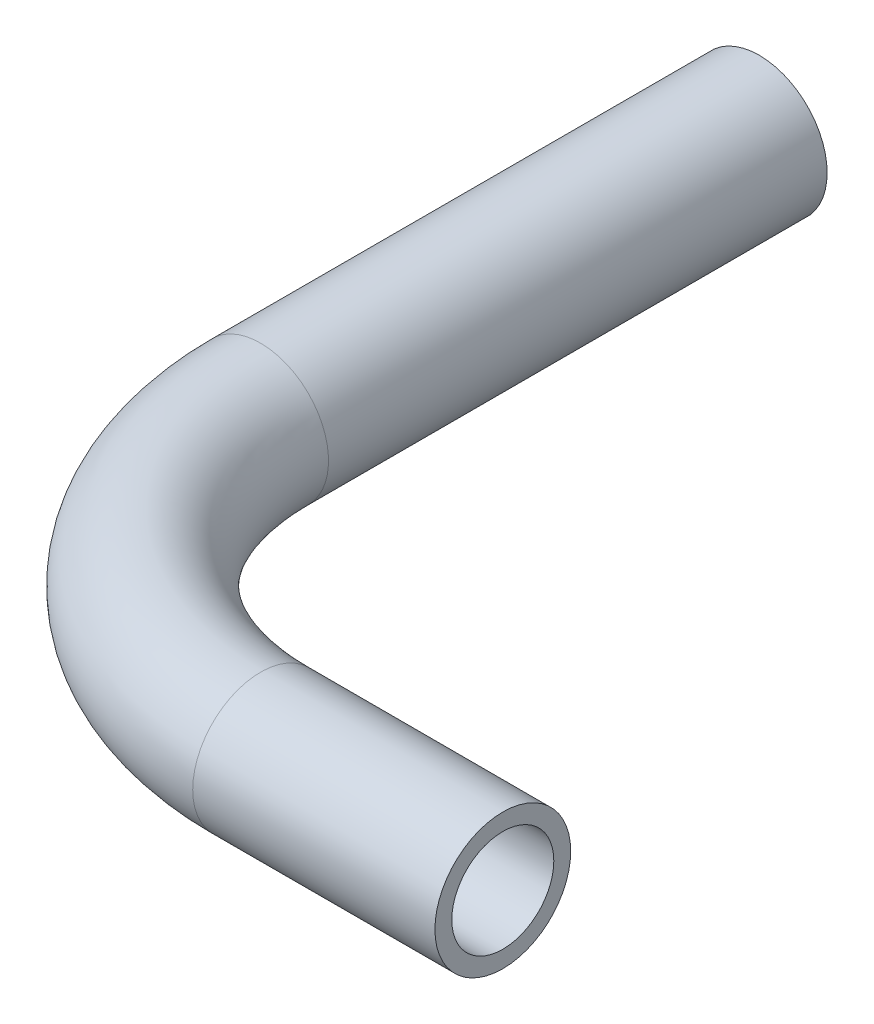
ISO-10303-21;
HEADER;
FILE_DESCRIPTION(('STEP AP214'),'2;1');
FILE_NAME('part.step','',(''),(''),'','','');
FILE_SCHEMA(('AUTOMOTIVE_DESIGN { 1 0 10303 214 1 1 1 1 }'));
ENDSEC;
DATA;
#1=APPLICATION_CONTEXT('core data for automotive mechanical design processes');
#2=APPLICATION_PROTOCOL_DEFINITION('international standard','automotive_design',2000,#1);
#3=PRODUCT_CONTEXT('',#1,'mechanical');
#4=PRODUCT('Part','Part','',(#3));
#5=PRODUCT_RELATED_PRODUCT_CATEGORY('part','',(#4));
#6=PRODUCT_DEFINITION_FORMATION('','',#4);
#7=PRODUCT_DEFINITION_CONTEXT('part definition',#1,'design');
#8=PRODUCT_DEFINITION('design','',#6,#7);
#9=PRODUCT_DEFINITION_SHAPE('','',#8);
#10=(LENGTH_UNIT() NAMED_UNIT(*) SI_UNIT(.MILLI.,.METRE.));
#11=(NAMED_UNIT(*) PLANE_ANGLE_UNIT() SI_UNIT($,.RADIAN.));
#12=(NAMED_UNIT(*) SI_UNIT($,.STERADIAN.) SOLID_ANGLE_UNIT());
#13=UNCERTAINTY_MEASURE_WITH_UNIT(LENGTH_MEASURE(1.E-05),#10,'distance_accuracy_value','');
#14=(GEOMETRIC_REPRESENTATION_CONTEXT(3) GLOBAL_UNCERTAINTY_ASSIGNED_CONTEXT((#13)) GLOBAL_UNIT_ASSIGNED_CONTEXT((#10,
#11,#12)) REPRESENTATION_CONTEXT('',''));
#15=CARTESIAN_POINT('',(0.,0.,0.));
#16=DIRECTION('',(0.,0.,1.));
#17=DIRECTION('',(1.,0.,0.));
#18=AXIS2_PLACEMENT_3D('',#15,#16,#17);
#19=CARTESIAN_POINT('',(20.,0.,55.));
#20=DIRECTION('',(1.,0.,0.));
#21=DIRECTION('',(0.,1.,0.));
#22=AXIS2_PLACEMENT_3D('',#19,#20,#21);
#23=CYLINDRICAL_SURFACE('',#22,4.765);
#24=CARTESIAN_POINT('',(20.,0.,55.));
#25=DIRECTION('',(1.,0.,0.));
#26=DIRECTION('',(0.,0.,-1.));
#27=AXIS2_PLACEMENT_3D('',#24,#25,#26);
#28=CIRCLE('',#27,4.765);
#29=CARTESIAN_POINT('',(20.,0.,59.765));
#30=VERTEX_POINT('',#29);
#31=EDGE_CURVE('E37',#30,#30,#28,.T.);
#32=ORIENTED_EDGE('',*,*,#31,.T.);
#33=EDGE_LOOP('',(#32));
#34=FACE_BOUND('',#33,.T.);
#35=CARTESIAN_POINT('',(37.,0.,55.));
#36=DIRECTION('',(1.,0.,0.));
#37=DIRECTION('',(0.,0.,-1.));
#38=AXIS2_PLACEMENT_3D('',#35,#36,#37);
#39=CIRCLE('',#38,4.765);
#40=CARTESIAN_POINT('',(37.,0.,50.235));
#41=VERTEX_POINT('',#40);
#42=EDGE_CURVE('E10',#41,#41,#39,.T.);
#43=ORIENTED_EDGE('',*,*,#42,.F.);
#44=EDGE_LOOP('',(#43));
#45=FACE_BOUND('',#44,.T.);
#46=ADVANCED_FACE('F27',(#34,#45),#23,.T.);
#47=CARTESIAN_POINT('',(20.,0.,55.));
#48=DIRECTION('',(1.,0.,0.));
#49=DIRECTION('',(0.,1.,0.));
#50=AXIS2_PLACEMENT_3D('',#47,#48,#49);
#51=CYLINDRICAL_SURFACE('',#50,3.58);
#52=CARTESIAN_POINT('',(20.,0.,55.));
#53=DIRECTION('',(1.,0.,0.));
#54=DIRECTION('',(0.,0.,-1.));
#55=AXIS2_PLACEMENT_3D('',#52,#53,#54);
#56=CIRCLE('',#55,3.58);
#57=CARTESIAN_POINT('',(20.,0.,58.58));
#58=VERTEX_POINT('',#57);
#59=EDGE_CURVE('E41',#58,#58,#56,.T.);
#60=ORIENTED_EDGE('',*,*,#59,.F.);
#61=EDGE_LOOP('',(#60));
#62=FACE_BOUND('',#61,.T.);
#63=CARTESIAN_POINT('',(37.,0.,55.));
#64=DIRECTION('',(1.,0.,0.));
#65=DIRECTION('',(0.,0.,-1.));
#66=AXIS2_PLACEMENT_3D('',#63,#64,#65);
#67=CIRCLE('',#66,3.58);
#68=CARTESIAN_POINT('',(37.,0.,51.42));
#69=VERTEX_POINT('',#68);
#70=EDGE_CURVE('E33',#69,#69,#67,.T.);
#71=ORIENTED_EDGE('',*,*,#70,.T.);
#72=EDGE_LOOP('',(#71));
#73=FACE_BOUND('',#72,.T.);
#74=ADVANCED_FACE('F69',(#62,#73),#51,.F.);
#75=CARTESIAN_POINT('',(20.,0.,35.));
#76=DIRECTION('',(0.,1.,0.));
#77=DIRECTION('',(0.,0.,1.));
#78=AXIS2_PLACEMENT_3D('',#75,#76,#77);
#79=TOROIDAL_SURFACE('',#78,20.,4.765);
#80=CARTESIAN_POINT('',(0.,0.,35.));
#81=DIRECTION('',(0.,0.,1.));
#82=DIRECTION('',(1.,0.,0.));
#83=AXIS2_PLACEMENT_3D('',#80,#81,#82);
#84=CIRCLE('',#83,4.765);
#85=CARTESIAN_POINT('',(-4.765,0.,35.));
#86=VERTEX_POINT('',#85);
#87=EDGE_CURVE('E46',#86,#86,#84,.T.);
#88=CARTESIAN_POINT('',(20.,0.,35.));
#89=DIRECTION('',(0.,1.,0.));
#90=DIRECTION('',(0.,0.,1.));
#91=AXIS2_PLACEMENT_3D('',#88,#89,#90);
#92=CIRCLE('',#91,24.765);
#93=EDGE_CURVE('',#86,#30,#92,.T.);
#94=ORIENTED_EDGE('',*,*,#87,.T.);
#95=ORIENTED_EDGE('',*,*,#31,.F.);
#96=ORIENTED_EDGE('',*,*,#93,.T.);
#97=ORIENTED_EDGE('',*,*,#93,.F.);
#98=EDGE_LOOP('',(#94,#96,#95,#97));
#99=FACE_BOUND('',#98,.T.);
#100=ADVANCED_FACE('F65',(#99),#79,.T.);
#101=CARTESIAN_POINT('',(20.,0.,35.));
#102=DIRECTION('',(0.,1.,0.));
#103=DIRECTION('',(0.,0.,1.));
#104=AXIS2_PLACEMENT_3D('',#101,#102,#103);
#105=TOROIDAL_SURFACE('',#104,20.,3.58);
#106=CARTESIAN_POINT('',(0.,0.,35.));
#107=DIRECTION('',(0.,0.,1.));
#108=DIRECTION('',(1.,0.,0.));
#109=AXIS2_PLACEMENT_3D('',#106,#107,#108);
#110=CIRCLE('',#109,3.58);
#111=CARTESIAN_POINT('',(-3.58,0.,35.));
#112=VERTEX_POINT('',#111);
#113=EDGE_CURVE('E50',#112,#112,#110,.T.);
#114=CARTESIAN_POINT('',(20.,0.,35.));
#115=DIRECTION('',(0.,1.,0.));
#116=DIRECTION('',(0.,0.,1.));
#117=AXIS2_PLACEMENT_3D('',#114,#115,#116);
#118=CIRCLE('',#117,23.58);
#119=EDGE_CURVE('',#112,#58,#118,.T.);
#120=ORIENTED_EDGE('',*,*,#113,.F.);
#121=ORIENTED_EDGE('',*,*,#59,.T.);
#122=ORIENTED_EDGE('',*,*,#119,.T.);
#123=ORIENTED_EDGE('',*,*,#119,.F.);
#124=EDGE_LOOP('',(#120,#122,#121,#123));
#125=FACE_BOUND('',#124,.T.);
#126=ADVANCED_FACE('F62',(#125),#105,.F.);
#127=CARTESIAN_POINT('',(0.,0.,35.));
#128=DIRECTION('',(0.,0.,-1.));
#129=DIRECTION('',(-1.,0.,0.));
#130=AXIS2_PLACEMENT_3D('',#127,#128,#129);
#131=CYLINDRICAL_SURFACE('',#130,3.58);
#132=ORIENTED_EDGE('',*,*,#113,.T.);
#133=EDGE_LOOP('',(#132));
#134=FACE_BOUND('',#133,.T.);
#135=CARTESIAN_POINT('',(0.,0.,0.));
#136=DIRECTION('',(0.,0.,1.));
#137=DIRECTION('',(1.,0.,0.));
#138=AXIS2_PLACEMENT_3D('',#135,#136,#137);
#139=CIRCLE('',#138,3.58);
#140=CARTESIAN_POINT('',(3.58,0.,0.));
#141=VERTEX_POINT('',#140);
#142=EDGE_CURVE('E51',#141,#141,#139,.T.);
#143=ORIENTED_EDGE('',*,*,#142,.F.);
#144=EDGE_LOOP('',(#143));
#145=FACE_BOUND('',#144,.T.);
#146=ADVANCED_FACE('F59',(#134,#145),#131,.F.);
#147=CARTESIAN_POINT('',(0.,0.,35.));
#148=DIRECTION('',(0.,0.,-1.));
#149=DIRECTION('',(-1.,0.,0.));
#150=AXIS2_PLACEMENT_3D('',#147,#148,#149);
#151=CYLINDRICAL_SURFACE('',#150,4.765);
#152=ORIENTED_EDGE('',*,*,#87,.F.);
#153=EDGE_LOOP('',(#152));
#154=FACE_BOUND('',#153,.T.);
#155=CARTESIAN_POINT('',(0.,0.,0.));
#156=DIRECTION('',(0.,0.,1.));
#157=DIRECTION('',(1.,0.,0.));
#158=AXIS2_PLACEMENT_3D('',#155,#156,#157);
#159=CIRCLE('',#158,4.765);
#160=CARTESIAN_POINT('',(4.765,0.,0.));
#161=VERTEX_POINT('',#160);
#162=EDGE_CURVE('E47',#161,#161,#159,.T.);
#163=ORIENTED_EDGE('',*,*,#162,.T.);
#164=EDGE_LOOP('',(#163));
#165=FACE_BOUND('',#164,.T.);
#166=ADVANCED_FACE('F81',(#154,#165),#151,.T.);
#167=CARTESIAN_POINT('',(37.,0.,55.));
#168=DIRECTION('',(1.,0.,0.));
#169=DIRECTION('',(0.,0.,-1.));
#170=AXIS2_PLACEMENT_3D('',#167,#168,#169);
#171=PLANE('',#170);
#172=ORIENTED_EDGE('',*,*,#70,.F.);
#173=EDGE_LOOP('',(#172));
#174=FACE_BOUND('',#173,.T.);
#175=ORIENTED_EDGE('',*,*,#42,.T.);
#176=EDGE_LOOP('',(#175));
#177=FACE_BOUND('',#176,.T.);
#178=ADVANCED_FACE('F84',(#174,#177),#171,.T.);
#179=CARTESIAN_POINT('',(0.,0.,0.));
#180=DIRECTION('',(0.,0.,1.));
#181=DIRECTION('',(1.,0.,0.));
#182=AXIS2_PLACEMENT_3D('',#179,#180,#181);
#183=PLANE('',#182);
#184=ORIENTED_EDGE('',*,*,#142,.T.);
#185=EDGE_LOOP('',(#184));
#186=FACE_BOUND('',#185,.T.);
#187=ORIENTED_EDGE('',*,*,#162,.F.);
#188=EDGE_LOOP('',(#187));
#189=FACE_BOUND('',#188,.T.);
#190=ADVANCED_FACE('F86',(#186,#189),#183,.F.);
#191=CLOSED_SHELL('',(#46,#74,#100,#126,#146,#166,#178,#190));
#192=MANIFOLD_SOLID_BREP('B2',#191);
#193=ADVANCED_BREP_SHAPE_REPRESENTATION('',(#18,#192),#14);
#194=SHAPE_DEFINITION_REPRESENTATION(#9,#193);
ENDSEC;
END-ISO-10303-21;
